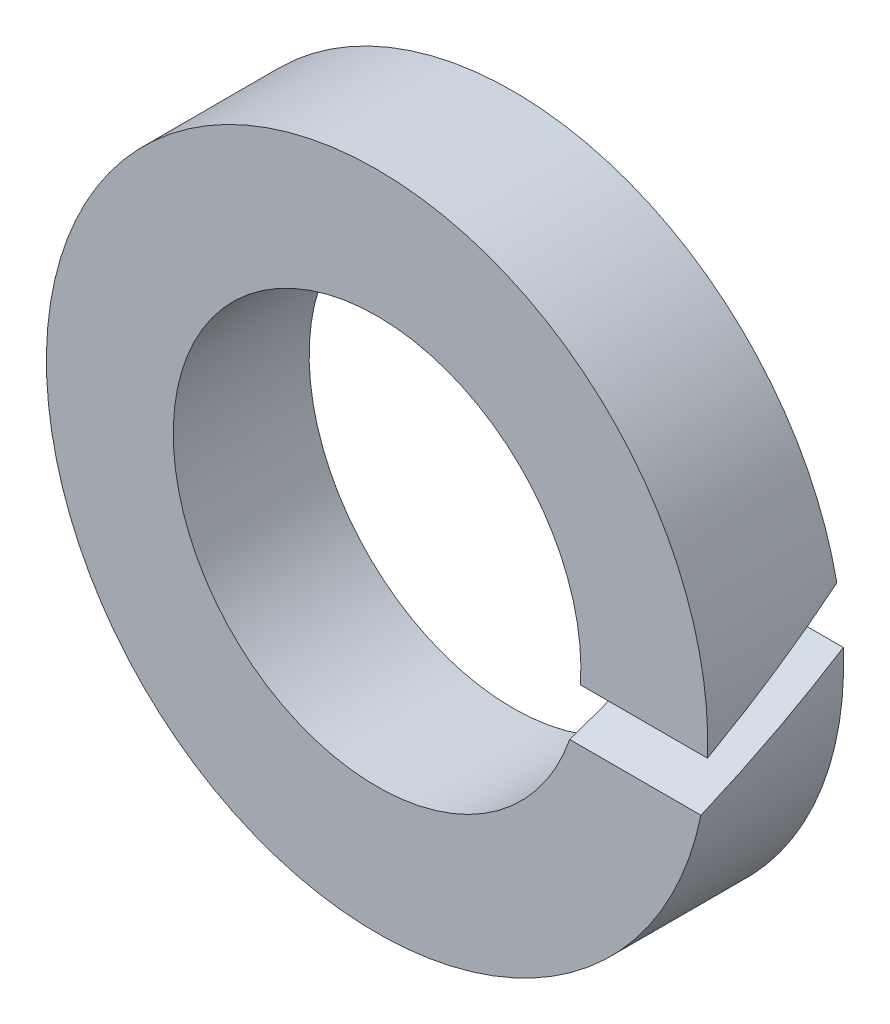
ISO-10303-21;
HEADER;
FILE_DESCRIPTION(('STEP AP214'),'2;1');
FILE_NAME('part.step','',(''),(''),'','','');
FILE_SCHEMA(('AUTOMOTIVE_DESIGN { 1 0 10303 214 1 1 1 1 }'));
ENDSEC;
DATA;
#1=APPLICATION_CONTEXT('core data for automotive mechanical design processes');
#2=APPLICATION_PROTOCOL_DEFINITION('international standard','automotive_design',2000,#1);
#3=PRODUCT_CONTEXT('',#1,'mechanical');
#4=PRODUCT('Part','Part','',(#3));
#5=PRODUCT_RELATED_PRODUCT_CATEGORY('part','',(#4));
#6=PRODUCT_DEFINITION_FORMATION('','',#4);
#7=PRODUCT_DEFINITION_CONTEXT('part definition',#1,'design');
#8=PRODUCT_DEFINITION('design','',#6,#7);
#9=PRODUCT_DEFINITION_SHAPE('','',#8);
#10=(LENGTH_UNIT() NAMED_UNIT(*) SI_UNIT(.MILLI.,.METRE.));
#11=(NAMED_UNIT(*) PLANE_ANGLE_UNIT() SI_UNIT($,.RADIAN.));
#12=(NAMED_UNIT(*) SI_UNIT($,.STERADIAN.) SOLID_ANGLE_UNIT());
#13=UNCERTAINTY_MEASURE_WITH_UNIT(LENGTH_MEASURE(1.E-05),#10,'distance_accuracy_value','');
#14=(GEOMETRIC_REPRESENTATION_CONTEXT(3) GLOBAL_UNCERTAINTY_ASSIGNED_CONTEXT((#13)) GLOBAL_UNIT_ASSIGNED_CONTEXT((#10,
#11,#12)) REPRESENTATION_CONTEXT('',''));
#15=CARTESIAN_POINT('',(0.,0.,0.));
#16=DIRECTION('',(0.,0.,1.));
#17=DIRECTION('',(1.,0.,0.));
#18=AXIS2_PLACEMENT_3D('',#15,#16,#17);
#19=CARTESIAN_POINT('',(0.,0.,1.5));
#20=DIRECTION('',(0.,0.,1.));
#21=DIRECTION('',(1.,0.,0.));
#22=AXIS2_PLACEMENT_3D('',#19,#20,#21);
#23=PLANE('',#22);
#24=CARTESIAN_POINT('',(0.,0.,1.5));
#25=DIRECTION('',(0.,0.,1.));
#26=DIRECTION('',(1.,0.,0.));
#27=AXIS2_PLACEMENT_3D('',#24,#25,#26);
#28=CIRCLE('',#27,3.65);
#29=CARTESIAN_POINT('',(3.64673621354377,-0.154321057627028,1.5));
#30=VERTEX_POINT('',#29);
#31=CARTESIAN_POINT('',(3.57508384039289,-0.735714301996038,1.5));
#32=VERTEX_POINT('',#31);
#33=EDGE_CURVE('E76',#30,#32,#28,.T.);
#34=ORIENTED_EDGE('',*,*,#33,.T.);
#35=DIRECTION('',(-1.,0.,0.));
#36=VECTOR('',#35,1.);
#37=CARTESIAN_POINT('',(3.64999999999992,-0.735714301995983,1.5));
#38=LINE('',#37,#36);
#39=CARTESIAN_POINT('',(2.12631711318838,-0.735714301995871,1.5));
#40=VERTEX_POINT('',#39);
#41=EDGE_CURVE('E78',#32,#40,#38,.T.);
#42=ORIENTED_EDGE('',*,*,#41,.T.);
#43=CARTESIAN_POINT('',(0.,0.,1.5));
#44=DIRECTION('',(0.,0.,1.));
#45=DIRECTION('',(1.,0.,0.));
#46=AXIS2_PLACEMENT_3D('',#43,#44,#45);
#47=CIRCLE('',#46,2.25);
#48=CARTESIAN_POINT('',(2.24470154166919,-0.154321057627055,1.5));
#49=VERTEX_POINT('',#48);
#50=EDGE_CURVE('E88',#49,#40,#47,.T.);
#51=ORIENTED_EDGE('',*,*,#50,.F.);
#52=DIRECTION('',(-1.,0.,0.));
#53=VECTOR('',#52,1.);
#54=CARTESIAN_POINT('',(3.64999999999992,-0.154321057627167,1.5));
#55=LINE('',#54,#53);
#56=EDGE_CURVE('E52',#30,#49,#55,.T.);
#57=ORIENTED_EDGE('',*,*,#56,.F.);
#58=EDGE_LOOP('',(#34,#42,#51,#57));
#59=FACE_BOUND('',#58,.T.);
#60=ADVANCED_FACE('F30',(#59),#23,.T.);
#61=CARTESIAN_POINT('',(0.,0.,0.));
#62=DIRECTION('',(0.,0.,1.));
#63=DIRECTION('',(1.,0.,0.));
#64=AXIS2_PLACEMENT_3D('',#61,#62,#63);
#65=PLANE('',#64);
#66=DIRECTION('',(-1.,0.,0.));
#67=VECTOR('',#66,1.);
#68=CARTESIAN_POINT('',(3.64999999999984,0.154321057627443,0.));
#69=LINE('',#68,#67);
#70=CARTESIAN_POINT('',(3.64673621354383,0.154321057627359,0.));
#71=VERTEX_POINT('',#70);
#72=CARTESIAN_POINT('',(2.24470154166922,0.154321057627305,0.));
#73=VERTEX_POINT('',#72);
#74=EDGE_CURVE('E45',#71,#73,#69,.T.);
#75=ORIENTED_EDGE('',*,*,#74,.F.);
#76=CARTESIAN_POINT('',(0.,0.,0.));
#77=DIRECTION('',(0.,0.,1.));
#78=DIRECTION('',(1.,0.,0.));
#79=AXIS2_PLACEMENT_3D('',#76,#77,#78);
#80=CIRCLE('',#79,3.65);
#81=CARTESIAN_POINT('',(3.57508384039275,0.735714301996239,0.));
#82=VERTEX_POINT('',#81);
#83=EDGE_CURVE('E74',#82,#71,#80,.T.);
#84=ORIENTED_EDGE('',*,*,#83,.F.);
#85=DIRECTION('',(-1.,0.,0.));
#86=VECTOR('',#85,1.);
#87=CARTESIAN_POINT('',(3.64999999999987,0.735714301996231,0.));
#88=LINE('',#87,#86);
#89=CARTESIAN_POINT('',(2.12631711318841,0.735714301996288,0.));
#90=VERTEX_POINT('',#89);
#91=EDGE_CURVE('E81',#82,#90,#88,.T.);
#92=ORIENTED_EDGE('',*,*,#91,.T.);
#93=CARTESIAN_POINT('',(0.,0.,0.));
#94=DIRECTION('',(0.,0.,1.));
#95=DIRECTION('',(1.,0.,0.));
#96=AXIS2_PLACEMENT_3D('',#93,#94,#95);
#97=CIRCLE('',#96,2.25);
#98=EDGE_CURVE('E92',#90,#73,#97,.T.);
#99=ORIENTED_EDGE('',*,*,#98,.T.);
#100=EDGE_LOOP('',(#75,#84,#92,#99));
#101=FACE_BOUND('',#100,.T.);
#102=ADVANCED_FACE('F87',(#101),#65,.F.);
#103=CARTESIAN_POINT('',(0.,0.,1.5));
#104=DIRECTION('',(0.,0.,-1.));
#105=DIRECTION('',(-1.,0.,0.));
#106=AXIS2_PLACEMENT_3D('',#103,#104,#105);
#107=CYLINDRICAL_SURFACE('',#106,3.65);
#108=CARTESIAN_POINT('',(0.,0.,0.26008133714911));
#109=DIRECTION('',(0.,0.860003112940858,0.510288786602296));
#110=DIRECTION('',(0.,0.510288786602297,-0.860003112940853));
#111=AXIS2_PLACEMENT_3D('',#108,#109,#110);
#112=ELLIPSE('',#111,7.15281247762301,3.65);
#113=EDGE_CURVE('E77',#32,#71,#112,.T.);
#114=ORIENTED_EDGE('',*,*,#113,.F.);
#115=ORIENTED_EDGE('',*,*,#33,.F.);
#116=CARTESIAN_POINT('',(0.,0.,1.23991866285089));
#117=DIRECTION('',(0.,0.860003112940859,0.510288786602296));
#118=DIRECTION('',(0.,0.510288786602297,-0.860003112940853));
#119=AXIS2_PLACEMENT_3D('',#116,#117,#118);
#120=ELLIPSE('',#119,7.15281247762301,3.65);
#121=EDGE_CURVE('E70',#30,#82,#120,.T.);
#122=ORIENTED_EDGE('',*,*,#121,.T.);
#123=ORIENTED_EDGE('',*,*,#83,.T.);
#124=EDGE_LOOP('',(#114,#115,#122,#123));
#125=FACE_BOUND('',#124,.T.);
#126=ADVANCED_FACE('F32',(#125),#107,.T.);
#127=CARTESIAN_POINT('',(0.,0.,1.5));
#128=DIRECTION('',(0.,0.,-1.));
#129=DIRECTION('',(-1.,0.,0.));
#130=AXIS2_PLACEMENT_3D('',#127,#128,#129);
#131=CYLINDRICAL_SURFACE('',#130,2.25);
#132=ORIENTED_EDGE('',*,*,#50,.T.);
#133=CARTESIAN_POINT('',(0.,0.,0.26008133714911));
#134=DIRECTION('',(0.,0.860003112940858,0.510288786602296));
#135=DIRECTION('',(0.,0.510288786602297,-0.860003112940853));
#136=AXIS2_PLACEMENT_3D('',#133,#134,#135);
#137=ELLIPSE('',#136,4.40926796565802,2.25);
#138=EDGE_CURVE('E11',#40,#73,#137,.T.);
#139=ORIENTED_EDGE('',*,*,#138,.T.);
#140=ORIENTED_EDGE('',*,*,#98,.F.);
#141=CARTESIAN_POINT('',(0.,0.,1.23991866285089));
#142=DIRECTION('',(0.,0.860003112940859,0.510288786602296));
#143=DIRECTION('',(0.,0.510288786602297,-0.860003112940853));
#144=AXIS2_PLACEMENT_3D('',#141,#142,#143);
#145=ELLIPSE('',#144,4.40926796565802,2.25);
#146=EDGE_CURVE('E38',#49,#90,#145,.T.);
#147=ORIENTED_EDGE('',*,*,#146,.F.);
#148=EDGE_LOOP('',(#132,#139,#140,#147));
#149=FACE_BOUND('',#148,.T.);
#150=ADVANCED_FACE('F103',(#149),#131,.F.);
#151=CARTESIAN_POINT('',(3.64999999999992,-0.154321057627167,1.5));
#152=DIRECTION('',(0.,0.860003112940859,0.510288786602296));
#153=DIRECTION('',(0.,-0.510288786602297,0.860003112940853));
#154=AXIS2_PLACEMENT_3D('',#151,#152,#153);
#155=PLANE('',#154);
#156=ORIENTED_EDGE('',*,*,#56,.T.);
#157=ORIENTED_EDGE('',*,*,#146,.T.);
#158=ORIENTED_EDGE('',*,*,#91,.F.);
#159=ORIENTED_EDGE('',*,*,#121,.F.);
#160=EDGE_LOOP('',(#156,#157,#158,#159));
#161=FACE_BOUND('',#160,.T.);
#162=ADVANCED_FACE('F82',(#161),#155,.F.);
#163=CARTESIAN_POINT('',(3.64999999999992,-0.735714301995983,1.5));
#164=DIRECTION('',(0.,0.860003112940858,0.510288786602296));
#165=DIRECTION('',(0.,-0.510288786602297,0.860003112940853));
#166=AXIS2_PLACEMENT_3D('',#163,#164,#165);
#167=PLANE('',#166);
#168=ORIENTED_EDGE('',*,*,#113,.T.);
#169=ORIENTED_EDGE('',*,*,#74,.T.);
#170=ORIENTED_EDGE('',*,*,#138,.F.);
#171=ORIENTED_EDGE('',*,*,#41,.F.);
#172=EDGE_LOOP('',(#168,#169,#170,#171));
#173=FACE_BOUND('',#172,.T.);
#174=ADVANCED_FACE('F104',(#173),#167,.T.);
#175=CLOSED_SHELL('',(#60,#102,#126,#150,#162,#174));
#176=MANIFOLD_SOLID_BREP('B2',#175);
#177=ADVANCED_BREP_SHAPE_REPRESENTATION('',(#18,#176),#14);
#178=SHAPE_DEFINITION_REPRESENTATION(#9,#177);
ENDSEC;
END-ISO-10303-21;
